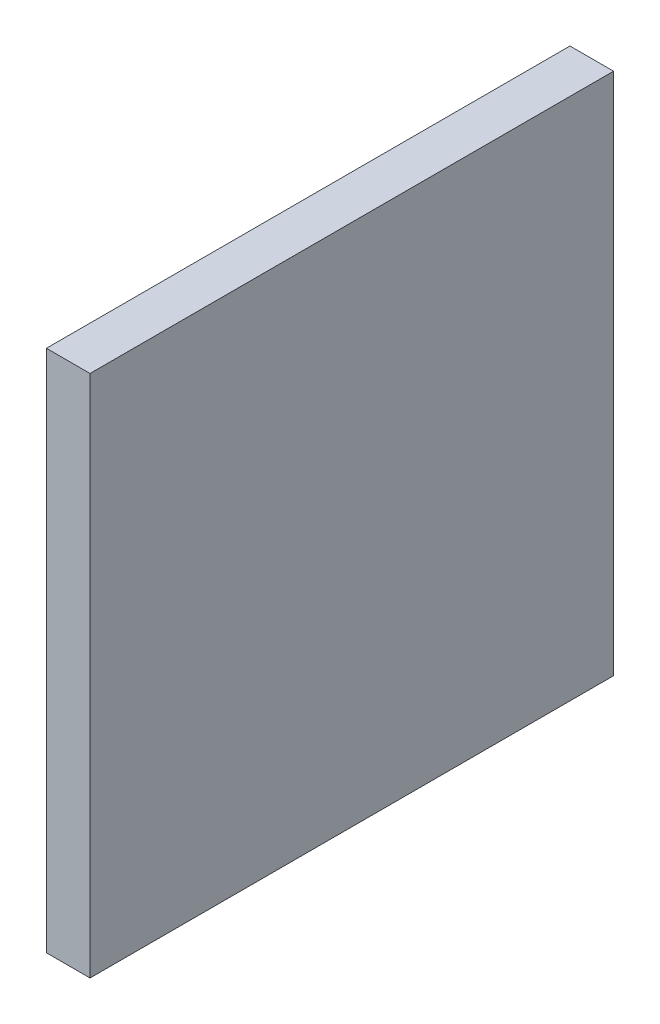
ISO-10303-21;
HEADER;
FILE_DESCRIPTION(('STEP AP214'),'2;1');
FILE_NAME('part.step','',(''),(''),'','','');
FILE_SCHEMA(('AUTOMOTIVE_DESIGN { 1 0 10303 214 1 1 1 1 }'));
ENDSEC;
DATA;
#1=APPLICATION_CONTEXT('core data for automotive mechanical design processes');
#2=APPLICATION_PROTOCOL_DEFINITION('international standard','automotive_design',2000,#1);
#3=PRODUCT_CONTEXT('',#1,'mechanical');
#4=PRODUCT('Part','Part','',(#3));
#5=PRODUCT_RELATED_PRODUCT_CATEGORY('part','',(#4));
#6=PRODUCT_DEFINITION_FORMATION('','',#4);
#7=PRODUCT_DEFINITION_CONTEXT('part definition',#1,'design');
#8=PRODUCT_DEFINITION('design','',#6,#7);
#9=PRODUCT_DEFINITION_SHAPE('','',#8);
#10=(LENGTH_UNIT() NAMED_UNIT(*) SI_UNIT(.MILLI.,.METRE.));
#11=(NAMED_UNIT(*) PLANE_ANGLE_UNIT() SI_UNIT($,.RADIAN.));
#12=(NAMED_UNIT(*) SI_UNIT($,.STERADIAN.) SOLID_ANGLE_UNIT());
#13=UNCERTAINTY_MEASURE_WITH_UNIT(LENGTH_MEASURE(1.E-05),#10,'distance_accuracy_value','');
#14=(GEOMETRIC_REPRESENTATION_CONTEXT(3) GLOBAL_UNCERTAINTY_ASSIGNED_CONTEXT((#13)) GLOBAL_UNIT_ASSIGNED_CONTEXT((#10,
#11,#12)) REPRESENTATION_CONTEXT('',''));
#15=CARTESIAN_POINT('',(0.,0.,0.));
#16=DIRECTION('',(0.,0.,1.));
#17=DIRECTION('',(1.,0.,0.));
#18=AXIS2_PLACEMENT_3D('',#15,#16,#17);
#19=CARTESIAN_POINT('',(0.,-457.2,190.5));
#20=DIRECTION('',(-1.,0.,0.));
#21=DIRECTION('',(0.,0.,1.));
#22=AXIS2_PLACEMENT_3D('',#19,#20,#21);
#23=PLANE('',#22);
#24=DIRECTION('',(0.,0.,1.));
#25=VECTOR('',#24,1.);
#26=CARTESIAN_POINT('',(0.,0.,190.5));
#27=LINE('',#26,#25);
#28=CARTESIAN_POINT('',(0.,0.,0.));
#29=VERTEX_POINT('',#28);
#30=CARTESIAN_POINT('',(0.,0.,457.2));
#31=VERTEX_POINT('',#30);
#32=EDGE_CURVE('E101',#29,#31,#27,.T.);
#33=ORIENTED_EDGE('',*,*,#32,.F.);
#34=DIRECTION('',(0.,1.,0.));
#35=VECTOR('',#34,1.);
#36=CARTESIAN_POINT('',(0.,-457.2,0.));
#37=LINE('',#36,#35);
#38=CARTESIAN_POINT('',(0.,-457.2,0.));
#39=VERTEX_POINT('',#38);
#40=EDGE_CURVE('E10',#39,#29,#37,.T.);
#41=ORIENTED_EDGE('',*,*,#40,.F.);
#42=DIRECTION('',(0.,0.,1.));
#43=VECTOR('',#42,1.);
#44=CARTESIAN_POINT('',(0.,-457.2,190.5));
#45=LINE('',#44,#43);
#46=CARTESIAN_POINT('',(0.,-457.2,457.2));
#47=VERTEX_POINT('',#46);
#48=EDGE_CURVE('E79',#39,#47,#45,.T.);
#49=ORIENTED_EDGE('',*,*,#48,.T.);
#50=DIRECTION('',(0.,1.,0.));
#51=VECTOR('',#50,1.);
#52=CARTESIAN_POINT('',(0.,-457.2,457.2));
#53=LINE('',#52,#51);
#54=EDGE_CURVE('E38',#47,#31,#53,.T.);
#55=ORIENTED_EDGE('',*,*,#54,.T.);
#56=EDGE_LOOP('',(#33,#41,#49,#55));
#57=FACE_BOUND('',#56,.T.);
#58=ADVANCED_FACE('F16',(#57),#23,.T.);
#59=CARTESIAN_POINT('',(51.7014593019341,-457.2,0.));
#60=DIRECTION('',(0.,0.,1.));
#61=DIRECTION('',(1.,0.,0.));
#62=AXIS2_PLACEMENT_3D('',#59,#60,#61);
#63=PLANE('',#62);
#64=DIRECTION('',(1.,0.,0.));
#65=VECTOR('',#64,1.);
#66=CARTESIAN_POINT('',(51.7014593019341,0.,0.));
#67=LINE('',#66,#65);
#68=CARTESIAN_POINT('',(38.1,0.,0.));
#69=VERTEX_POINT('',#68);
#70=EDGE_CURVE('E86',#29,#69,#67,.T.);
#71=ORIENTED_EDGE('',*,*,#70,.T.);
#72=DIRECTION('',(0.,1.,0.));
#73=VECTOR('',#72,1.);
#74=CARTESIAN_POINT('',(38.1,-457.2,0.));
#75=LINE('',#74,#73);
#76=CARTESIAN_POINT('',(38.1,-457.2,0.));
#77=VERTEX_POINT('',#76);
#78=EDGE_CURVE('E25',#77,#69,#75,.T.);
#79=ORIENTED_EDGE('',*,*,#78,.F.);
#80=DIRECTION('',(1.,0.,0.));
#81=VECTOR('',#80,1.);
#82=CARTESIAN_POINT('',(51.7014593019341,-457.2,0.));
#83=LINE('',#82,#81);
#84=EDGE_CURVE('E73',#39,#77,#83,.T.);
#85=ORIENTED_EDGE('',*,*,#84,.F.);
#86=ORIENTED_EDGE('',*,*,#40,.T.);
#87=EDGE_LOOP('',(#71,#79,#85,#86));
#88=FACE_BOUND('',#87,.T.);
#89=ADVANCED_FACE('F84',(#88),#63,.F.);
#90=CARTESIAN_POINT('',(38.1,-457.2,190.5));
#91=DIRECTION('',(-1.,0.,0.));
#92=DIRECTION('',(0.,0.,1.));
#93=AXIS2_PLACEMENT_3D('',#90,#91,#92);
#94=PLANE('',#93);
#95=DIRECTION('',(0.,0.,1.));
#96=VECTOR('',#95,1.);
#97=CARTESIAN_POINT('',(38.1,0.,190.5));
#98=LINE('',#97,#96);
#99=CARTESIAN_POINT('',(38.1,0.,457.2));
#100=VERTEX_POINT('',#99);
#101=EDGE_CURVE('E106',#69,#100,#98,.T.);
#102=ORIENTED_EDGE('',*,*,#101,.T.);
#103=DIRECTION('',(0.,1.,0.));
#104=VECTOR('',#103,1.);
#105=CARTESIAN_POINT('',(38.1,-457.2,457.2));
#106=LINE('',#105,#104);
#107=CARTESIAN_POINT('',(38.1,-457.2,457.2));
#108=VERTEX_POINT('',#107);
#109=EDGE_CURVE('E56',#108,#100,#106,.T.);
#110=ORIENTED_EDGE('',*,*,#109,.F.);
#111=DIRECTION('',(0.,0.,1.));
#112=VECTOR('',#111,1.);
#113=CARTESIAN_POINT('',(38.1,-457.2,190.5));
#114=LINE('',#113,#112);
#115=EDGE_CURVE('E78',#77,#108,#114,.T.);
#116=ORIENTED_EDGE('',*,*,#115,.F.);
#117=ORIENTED_EDGE('',*,*,#78,.T.);
#118=EDGE_LOOP('',(#102,#110,#116,#117));
#119=FACE_BOUND('',#118,.T.);
#120=ADVANCED_FACE('F90',(#119),#94,.F.);
#121=CARTESIAN_POINT('',(51.7014593019341,-457.2,457.2));
#122=DIRECTION('',(0.,0.,1.));
#123=DIRECTION('',(1.,0.,0.));
#124=AXIS2_PLACEMENT_3D('',#121,#122,#123);
#125=PLANE('',#124);
#126=DIRECTION('',(1.,0.,0.));
#127=VECTOR('',#126,1.);
#128=CARTESIAN_POINT('',(51.7014593019341,0.,457.2));
#129=LINE('',#128,#127);
#130=EDGE_CURVE('E108',#31,#100,#129,.T.);
#131=ORIENTED_EDGE('',*,*,#130,.F.);
#132=ORIENTED_EDGE('',*,*,#54,.F.);
#133=DIRECTION('',(1.,0.,0.));
#134=VECTOR('',#133,1.);
#135=CARTESIAN_POINT('',(51.7014593019341,-457.2,457.2));
#136=LINE('',#135,#134);
#137=EDGE_CURVE('E92',#47,#108,#136,.T.);
#138=ORIENTED_EDGE('',*,*,#137,.T.);
#139=ORIENTED_EDGE('',*,*,#109,.T.);
#140=EDGE_LOOP('',(#131,#132,#138,#139));
#141=FACE_BOUND('',#140,.T.);
#142=ADVANCED_FACE('F127',(#141),#125,.T.);
#143=CARTESIAN_POINT('',(19.05,-457.2,228.6));
#144=DIRECTION('',(0.,-1.,0.));
#145=DIRECTION('',(1.,0.,0.));
#146=AXIS2_PLACEMENT_3D('',#143,#144,#145);
#147=PLANE('',#146);
#148=ORIENTED_EDGE('',*,*,#48,.F.);
#149=ORIENTED_EDGE('',*,*,#84,.T.);
#150=ORIENTED_EDGE('',*,*,#115,.T.);
#151=ORIENTED_EDGE('',*,*,#137,.F.);
#152=EDGE_LOOP('',(#148,#149,#150,#151));
#153=FACE_BOUND('',#152,.T.);
#154=ADVANCED_FACE('F75',(#153),#147,.T.);
#155=CARTESIAN_POINT('',(19.05,0.,228.6));
#156=DIRECTION('',(0.,-1.,0.));
#157=DIRECTION('',(1.,0.,0.));
#158=AXIS2_PLACEMENT_3D('',#155,#156,#157);
#159=PLANE('',#158);
#160=ORIENTED_EDGE('',*,*,#32,.T.);
#161=ORIENTED_EDGE('',*,*,#130,.T.);
#162=ORIENTED_EDGE('',*,*,#101,.F.);
#163=ORIENTED_EDGE('',*,*,#70,.F.);
#164=EDGE_LOOP('',(#160,#161,#162,#163));
#165=FACE_BOUND('',#164,.T.);
#166=ADVANCED_FACE('F133',(#165),#159,.F.);
#167=CLOSED_SHELL('',(#58,#89,#120,#142,#154,#166));
#168=MANIFOLD_SOLID_BREP('B1',#167);
#169=ADVANCED_BREP_SHAPE_REPRESENTATION('',(#18,#168),#14);
#170=SHAPE_DEFINITION_REPRESENTATION(#9,#169);
ENDSEC;
END-ISO-10303-21;
